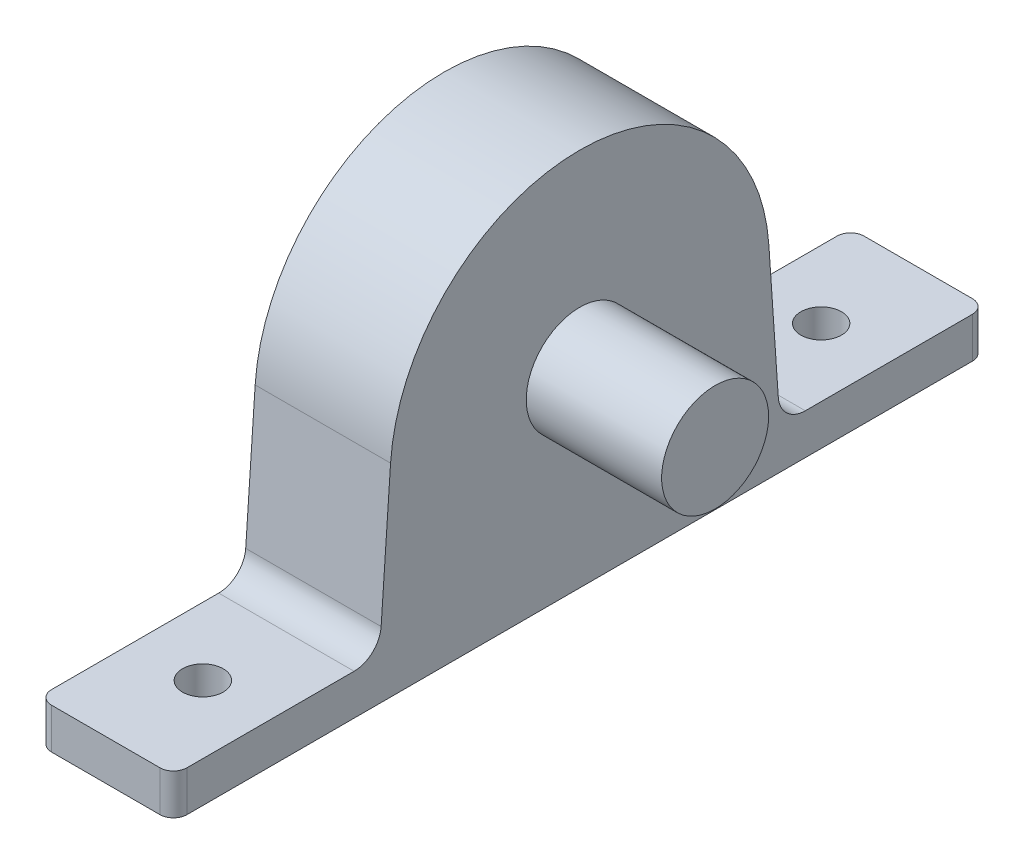
ISO-10303-21;
HEADER;
FILE_DESCRIPTION(('STEP AP214'),'2;1');
FILE_NAME('part.step','',(''),(''),'','','');
FILE_SCHEMA(('AUTOMOTIVE_DESIGN { 1 0 10303 214 1 1 1 1 }'));
ENDSEC;
DATA;
#1=APPLICATION_CONTEXT('core data for automotive mechanical design processes');
#2=APPLICATION_PROTOCOL_DEFINITION('international standard','automotive_design',2000,#1);
#3=PRODUCT_CONTEXT('',#1,'mechanical');
#4=PRODUCT('Part','Part','',(#3));
#5=PRODUCT_RELATED_PRODUCT_CATEGORY('part','',(#4));
#6=PRODUCT_DEFINITION_FORMATION('','',#4);
#7=PRODUCT_DEFINITION_CONTEXT('part definition',#1,'design');
#8=PRODUCT_DEFINITION('design','',#6,#7);
#9=PRODUCT_DEFINITION_SHAPE('','',#8);
#10=(LENGTH_UNIT() NAMED_UNIT(*) SI_UNIT(.MILLI.,.METRE.));
#11=(NAMED_UNIT(*) PLANE_ANGLE_UNIT() SI_UNIT($,.RADIAN.));
#12=(NAMED_UNIT(*) SI_UNIT($,.STERADIAN.) SOLID_ANGLE_UNIT());
#13=UNCERTAINTY_MEASURE_WITH_UNIT(LENGTH_MEASURE(1.E-05),#10,'distance_accuracy_value','');
#14=(GEOMETRIC_REPRESENTATION_CONTEXT(3) GLOBAL_UNCERTAINTY_ASSIGNED_CONTEXT((#13)) GLOBAL_UNIT_ASSIGNED_CONTEXT((#10,
#11,#12)) REPRESENTATION_CONTEXT('',''));
#15=CARTESIAN_POINT('',(0.,0.,0.));
#16=DIRECTION('',(0.,0.,1.));
#17=DIRECTION('',(1.,0.,0.));
#18=AXIS2_PLACEMENT_3D('',#15,#16,#17);
#19=CARTESIAN_POINT('',(-41.0365690573664,1.03079987136159,14.9288257231679));
#20=DIRECTION('',(0.,-0.0688836104513062,-0.997624703087886));
#21=DIRECTION('',(0.,0.997624703087886,-0.0688836104513062));
#22=AXIS2_PLACEMENT_3D('',#19,#20,#21);
#23=PLANE('',#22);
#24=DIRECTION('',(0.,0.997624703087886,-0.0688836104513062));
#25=VECTOR('',#24,1.);
#26=CARTESIAN_POINT('',(0.,1.03079987136159,14.9288257231679));
#27=LINE('',#26,#25);
#28=CARTESIAN_POINT('',(0.,4.86223277909739,14.664274403348));
#29=VERTEX_POINT('',#28);
#30=CARTESIAN_POINT('',(0.,14.9643705463183,13.9667458432304));
#31=VERTEX_POINT('',#30);
#32=EDGE_CURVE('E136',#29,#31,#27,.T.);
#33=ORIENTED_EDGE('',*,*,#32,.F.);
#34=DIRECTION('',(-1.,0.,0.));
#35=VECTOR('',#34,1.);
#36=CARTESIAN_POINT('',(10.,4.86223277909739,14.664274403348));
#37=LINE('',#36,#35);
#38=CARTESIAN_POINT('',(10.,4.86223277909739,14.664274403348));
#39=VERTEX_POINT('',#38);
#40=EDGE_CURVE('E60',#29,#39,#37,.F.);
#41=ORIENTED_EDGE('',*,*,#40,.T.);
#42=DIRECTION('',(0.,0.997624703087886,-0.0688836104513062));
#43=VECTOR('',#42,1.);
#44=CARTESIAN_POINT('',(10.,1.03079987136159,14.9288257231679));
#45=LINE('',#44,#43);
#46=CARTESIAN_POINT('',(10.,14.9643705463183,13.9667458432304));
#47=VERTEX_POINT('',#46);
#48=EDGE_CURVE('E148',#39,#47,#45,.T.);
#49=ORIENTED_EDGE('',*,*,#48,.T.);
#50=DIRECTION('',(1.,0.,0.));
#51=VECTOR('',#50,1.);
#52=CARTESIAN_POINT('',(-41.0365690573664,14.9643705463183,13.9667458432304));
#53=LINE('',#52,#51);
#54=EDGE_CURVE('E147',#31,#47,#53,.T.);
#55=ORIENTED_EDGE('',*,*,#54,.F.);
#56=EDGE_LOOP('',(#33,#41,#49,#55));
#57=FACE_BOUND('',#56,.T.);
#58=ADVANCED_FACE('F39',(#57),#23,.F.);
#59=CARTESIAN_POINT('',(-41.0365690573664,1.03079987136159,-14.9288257231679));
#60=DIRECTION('',(0.,0.068883610451306,-0.997624703087886));
#61=DIRECTION('',(0.,0.997624703087886,0.068883610451306));
#62=AXIS2_PLACEMENT_3D('',#59,#60,#61);
#63=PLANE('',#62);
#64=DIRECTION('',(0.,0.997624703087886,0.068883610451306));
#65=VECTOR('',#64,1.);
#66=CARTESIAN_POINT('',(10.,1.03079987136159,-14.9288257231679));
#67=LINE('',#66,#65);
#68=CARTESIAN_POINT('',(10.,4.86223277909739,-14.664274403348));
#69=VERTEX_POINT('',#68);
#70=CARTESIAN_POINT('',(10.,14.9643705463183,-13.9667458432304));
#71=VERTEX_POINT('',#70);
#72=EDGE_CURVE('E143',#69,#71,#67,.T.);
#73=ORIENTED_EDGE('',*,*,#72,.F.);
#74=DIRECTION('',(-1.,0.,0.));
#75=VECTOR('',#74,1.);
#76=CARTESIAN_POINT('',(-41.0365690573664,4.86223277909739,-14.664274403348));
#77=LINE('',#76,#75);
#78=CARTESIAN_POINT('',(0.,4.86223277909739,-14.664274403348));
#79=VERTEX_POINT('',#78);
#80=EDGE_CURVE('E214',#69,#79,#77,.T.);
#81=ORIENTED_EDGE('',*,*,#80,.T.);
#82=DIRECTION('',(0.,0.997624703087886,0.068883610451306));
#83=VECTOR('',#82,1.);
#84=CARTESIAN_POINT('',(0.,1.03079987136159,-14.9288257231679));
#85=LINE('',#84,#83);
#86=CARTESIAN_POINT('',(0.,14.9643705463183,-13.9667458432304));
#87=VERTEX_POINT('',#86);
#88=EDGE_CURVE('E161',#79,#87,#85,.T.);
#89=ORIENTED_EDGE('',*,*,#88,.T.);
#90=DIRECTION('',(1.,0.,0.));
#91=VECTOR('',#90,1.);
#92=CARTESIAN_POINT('',(-41.0365690573664,14.9643705463183,-13.9667458432304));
#93=LINE('',#92,#91);
#94=EDGE_CURVE('E155',#87,#71,#93,.T.);
#95=ORIENTED_EDGE('',*,*,#94,.T.);
#96=EDGE_LOOP('',(#73,#81,#89,#95));
#97=FACE_BOUND('',#96,.T.);
#98=ADVANCED_FACE('F238',(#97),#63,.T.);
#99=CARTESIAN_POINT('',(10.,0.,15.));
#100=DIRECTION('',(0.,1.,0.));
#101=DIRECTION('',(0.,0.,1.));
#102=AXIS2_PLACEMENT_3D('',#99,#100,#101);
#103=PLANE('',#102);
#104=CARTESIAN_POINT('',(5.,0.,-22.8297619047619));
#105=DIRECTION('',(0.,1.,0.));
#106=DIRECTION('',(0.,0.,1.));
#107=AXIS2_PLACEMENT_3D('',#104,#105,#106);
#108=CIRCLE('',#107,1.5);
#109=CARTESIAN_POINT('',(5.,0.,-21.3297619047619));
#110=VERTEX_POINT('',#109);
#111=EDGE_CURVE('E265',#110,#110,#108,.T.);
#112=ORIENTED_EDGE('',*,*,#111,.T.);
#113=EDGE_LOOP('',(#112));
#114=FACE_BOUND('',#113,.T.);
#115=CARTESIAN_POINT('',(5.,0.,22.8297619047619));
#116=DIRECTION('',(0.,1.,0.));
#117=DIRECTION('',(0.,0.,1.));
#118=AXIS2_PLACEMENT_3D('',#115,#116,#117);
#119=CIRCLE('',#118,1.5);
#120=CARTESIAN_POINT('',(5.,0.,24.3297619047619));
#121=VERTEX_POINT('',#120);
#122=EDGE_CURVE('E275',#121,#121,#119,.T.);
#123=ORIENTED_EDGE('',*,*,#122,.T.);
#124=EDGE_LOOP('',(#123));
#125=FACE_BOUND('',#124,.T.);
#126=DIRECTION('',(0.,0.,-1.));
#127=VECTOR('',#126,1.);
#128=CARTESIAN_POINT('',(0.,0.,15.));
#129=LINE('',#128,#127);
#130=CARTESIAN_POINT('',(0.,0.,29.));
#131=VERTEX_POINT('',#130);
#132=CARTESIAN_POINT('',(0.,0.,-29.));
#133=VERTEX_POINT('',#132);
#134=EDGE_CURVE('E167',#131,#133,#129,.T.);
#135=ORIENTED_EDGE('',*,*,#134,.T.);
#136=CARTESIAN_POINT('',(1.,0.,-29.));
#137=DIRECTION('',(0.,1.,0.));
#138=DIRECTION('',(0.,0.,1.));
#139=AXIS2_PLACEMENT_3D('',#136,#137,#138);
#140=CIRCLE('',#139,1.);
#141=CARTESIAN_POINT('',(1.,0.,-30.));
#142=VERTEX_POINT('',#141);
#143=EDGE_CURVE('E187',#133,#142,#140,.F.);
#144=ORIENTED_EDGE('',*,*,#143,.T.);
#145=DIRECTION('',(1.,0.,0.));
#146=VECTOR('',#145,1.);
#147=CARTESIAN_POINT('',(0.,0.,-30.));
#148=LINE('',#147,#146);
#149=CARTESIAN_POINT('',(9.,0.,-30.));
#150=VERTEX_POINT('',#149);
#151=EDGE_CURVE('E252',#142,#150,#148,.T.);
#152=ORIENTED_EDGE('',*,*,#151,.T.);
#153=CARTESIAN_POINT('',(9.,0.,-29.));
#154=DIRECTION('',(0.,1.,0.));
#155=DIRECTION('',(0.,0.,1.));
#156=AXIS2_PLACEMENT_3D('',#153,#154,#155);
#157=CIRCLE('',#156,1.);
#158=CARTESIAN_POINT('',(10.,0.,-29.));
#159=VERTEX_POINT('',#158);
#160=EDGE_CURVE('E181',#150,#159,#157,.F.);
#161=ORIENTED_EDGE('',*,*,#160,.T.);
#162=DIRECTION('',(0.,0.,-1.));
#163=VECTOR('',#162,1.);
#164=CARTESIAN_POINT('',(10.,0.,15.));
#165=LINE('',#164,#163);
#166=CARTESIAN_POINT('',(10.,0.,29.));
#167=VERTEX_POINT('',#166);
#168=EDGE_CURVE('E172',#167,#159,#165,.T.);
#169=ORIENTED_EDGE('',*,*,#168,.F.);
#170=CARTESIAN_POINT('',(9.,0.,29.));
#171=DIRECTION('',(0.,1.,0.));
#172=DIRECTION('',(0.,0.,1.));
#173=AXIS2_PLACEMENT_3D('',#170,#171,#172);
#174=CIRCLE('',#173,1.);
#175=CARTESIAN_POINT('',(9.,0.,30.));
#176=VERTEX_POINT('',#175);
#177=EDGE_CURVE('E183',#167,#176,#174,.F.);
#178=ORIENTED_EDGE('',*,*,#177,.T.);
#179=DIRECTION('',(-1.,0.,0.));
#180=VECTOR('',#179,1.);
#181=CARTESIAN_POINT('',(0.,0.,30.));
#182=LINE('',#181,#180);
#183=CARTESIAN_POINT('',(1.,0.,30.));
#184=VERTEX_POINT('',#183);
#185=EDGE_CURVE('E248',#176,#184,#182,.T.);
#186=ORIENTED_EDGE('',*,*,#185,.T.);
#187=CARTESIAN_POINT('',(1.,0.,29.));
#188=DIRECTION('',(0.,1.,0.));
#189=DIRECTION('',(0.,0.,1.));
#190=AXIS2_PLACEMENT_3D('',#187,#188,#189);
#191=CIRCLE('',#190,1.);
#192=EDGE_CURVE('E185',#184,#131,#191,.F.);
#193=ORIENTED_EDGE('',*,*,#192,.T.);
#194=EDGE_LOOP('',(#135,#144,#152,#161,#169,#178,#186,#193));
#195=FACE_BOUND('',#194,.T.);
#196=ADVANCED_FACE('F314',(#114,#125,#195),#103,.F.);
#197=CARTESIAN_POINT('',(10.,14.,0.));
#198=DIRECTION('',(-1.,0.,0.));
#199=DIRECTION('',(0.,0.,1.));
#200=AXIS2_PLACEMENT_3D('',#197,#198,#199);
#201=PLANE('',#200);
#202=ORIENTED_EDGE('',*,*,#48,.F.);
#203=CARTESIAN_POINT('',(10.,5.,16.6595238095238));
#204=DIRECTION('',(-1.,0.,0.));
#205=DIRECTION('',(0.,0.,1.));
#206=AXIS2_PLACEMENT_3D('',#203,#204,#205);
#207=CIRCLE('',#206,2.);
#208=CARTESIAN_POINT('',(10.,3.,16.6595238095238));
#209=VERTEX_POINT('',#208);
#210=EDGE_CURVE('E11',#39,#209,#207,.T.);
#211=ORIENTED_EDGE('',*,*,#210,.T.);
#212=DIRECTION('',(0.,0.,1.));
#213=VECTOR('',#212,1.);
#214=CARTESIAN_POINT('',(10.,3.,30.));
#215=LINE('',#214,#213);
#216=CARTESIAN_POINT('',(10.,3.,29.));
#217=VERTEX_POINT('',#216);
#218=EDGE_CURVE('E260',#209,#217,#215,.T.);
#219=ORIENTED_EDGE('',*,*,#218,.T.);
#220=DIRECTION('',(0.,-1.,0.));
#221=VECTOR('',#220,1.);
#222=CARTESIAN_POINT('',(10.,0.,29.));
#223=LINE('',#222,#221);
#224=EDGE_CURVE('E211',#217,#167,#223,.T.);
#225=ORIENTED_EDGE('',*,*,#224,.T.);
#226=ORIENTED_EDGE('',*,*,#168,.T.);
#227=DIRECTION('',(0.,-1.,0.));
#228=VECTOR('',#227,1.);
#229=CARTESIAN_POINT('',(10.,3.,-29.));
#230=LINE('',#229,#228);
#231=CARTESIAN_POINT('',(10.,3.,-29.));
#232=VERTEX_POINT('',#231);
#233=EDGE_CURVE('E209',#159,#232,#230,.F.);
#234=ORIENTED_EDGE('',*,*,#233,.T.);
#235=CARTESIAN_POINT('',(10.,3.,-16.6595238095238));
#236=VERTEX_POINT('',#235);
#237=EDGE_CURVE('E233',#232,#236,#215,.T.);
#238=ORIENTED_EDGE('',*,*,#237,.T.);
#239=CARTESIAN_POINT('',(10.,5.,-16.6595238095238));
#240=DIRECTION('',(-1.,0.,0.));
#241=DIRECTION('',(0.,0.,1.));
#242=AXIS2_PLACEMENT_3D('',#239,#240,#241);
#243=CIRCLE('',#242,2.);
#244=EDGE_CURVE('E225',#236,#69,#243,.T.);
#245=ORIENTED_EDGE('',*,*,#244,.T.);
#246=ORIENTED_EDGE('',*,*,#72,.T.);
#247=CARTESIAN_POINT('',(10.,14.,0.));
#248=DIRECTION('',(1.,0.,0.));
#249=DIRECTION('',(0.,0.,-1.));
#250=AXIS2_PLACEMENT_3D('',#247,#248,#249);
#251=CIRCLE('',#250,14.);
#252=EDGE_CURVE('E156',#71,#47,#251,.T.);
#253=ORIENTED_EDGE('',*,*,#252,.T.);
#254=EDGE_LOOP('',(#202,#211,#219,#225,#226,#234,#238,#245,#246,#253));
#255=FACE_BOUND('',#254,.T.);
#256=CARTESIAN_POINT('',(10.,14.,0.));
#257=DIRECTION('',(1.,0.,0.));
#258=DIRECTION('',(0.,0.,-1.));
#259=AXIS2_PLACEMENT_3D('',#256,#257,#258);
#260=CIRCLE('',#259,3.95);
#261=CARTESIAN_POINT('',(10.,14.,-3.95));
#262=VERTEX_POINT('',#261);
#263=EDGE_CURVE('E168',#262,#262,#260,.T.);
#264=ORIENTED_EDGE('',*,*,#263,.F.);
#265=EDGE_LOOP('',(#264));
#266=FACE_BOUND('',#265,.T.);
#267=ADVANCED_FACE('F230',(#255,#266),#201,.F.);
#268=CARTESIAN_POINT('',(0.,14.,0.));
#269=DIRECTION('',(-1.,0.,0.));
#270=DIRECTION('',(0.,0.,1.));
#271=AXIS2_PLACEMENT_3D('',#268,#269,#270);
#272=PLANE('',#271);
#273=ORIENTED_EDGE('',*,*,#88,.F.);
#274=CARTESIAN_POINT('',(0.,5.,-16.6595238095238));
#275=DIRECTION('',(-1.,0.,0.));
#276=DIRECTION('',(0.,0.,1.));
#277=AXIS2_PLACEMENT_3D('',#274,#275,#276);
#278=CIRCLE('',#277,2.);
#279=CARTESIAN_POINT('',(0.,3.,-16.6595238095238));
#280=VERTEX_POINT('',#279);
#281=EDGE_CURVE('E223',#79,#280,#278,.F.);
#282=ORIENTED_EDGE('',*,*,#281,.T.);
#283=DIRECTION('',(0.,0.,-1.));
#284=VECTOR('',#283,1.);
#285=CARTESIAN_POINT('',(0.,3.,30.));
#286=LINE('',#285,#284);
#287=CARTESIAN_POINT('',(0.,3.,-29.));
#288=VERTEX_POINT('',#287);
#289=EDGE_CURVE('E241',#280,#288,#286,.T.);
#290=ORIENTED_EDGE('',*,*,#289,.T.);
#291=DIRECTION('',(0.,-1.,0.));
#292=VECTOR('',#291,1.);
#293=CARTESIAN_POINT('',(0.,14.,-29.));
#294=LINE('',#293,#292);
#295=EDGE_CURVE('E178',#288,#133,#294,.T.);
#296=ORIENTED_EDGE('',*,*,#295,.T.);
#297=ORIENTED_EDGE('',*,*,#134,.F.);
#298=DIRECTION('',(0.,-1.,0.));
#299=VECTOR('',#298,1.);
#300=CARTESIAN_POINT('',(0.,14.,29.));
#301=LINE('',#300,#299);
#302=CARTESIAN_POINT('',(0.,3.,29.));
#303=VERTEX_POINT('',#302);
#304=EDGE_CURVE('E171',#131,#303,#301,.F.);
#305=ORIENTED_EDGE('',*,*,#304,.T.);
#306=CARTESIAN_POINT('',(0.,3.,16.6595238095238));
#307=VERTEX_POINT('',#306);
#308=EDGE_CURVE('E247',#303,#307,#286,.T.);
#309=ORIENTED_EDGE('',*,*,#308,.T.);
#310=CARTESIAN_POINT('',(0.,5.,16.6595238095238));
#311=DIRECTION('',(-1.,0.,0.));
#312=DIRECTION('',(0.,0.,1.));
#313=AXIS2_PLACEMENT_3D('',#310,#311,#312);
#314=CIRCLE('',#313,2.);
#315=EDGE_CURVE('E47',#307,#29,#314,.F.);
#316=ORIENTED_EDGE('',*,*,#315,.T.);
#317=ORIENTED_EDGE('',*,*,#32,.T.);
#318=CARTESIAN_POINT('',(0.,14.,0.));
#319=DIRECTION('',(-1.,0.,0.));
#320=DIRECTION('',(0.,0.,1.));
#321=AXIS2_PLACEMENT_3D('',#318,#319,#320);
#322=CIRCLE('',#321,14.);
#323=EDGE_CURVE('E141',#87,#31,#322,.F.);
#324=ORIENTED_EDGE('',*,*,#323,.F.);
#325=EDGE_LOOP('',(#273,#282,#290,#296,#297,#305,#309,#316,#317,#324));
#326=FACE_BOUND('',#325,.T.);
#327=ADVANCED_FACE('F139',(#326),#272,.T.);
#328=CARTESIAN_POINT('',(20.,14.,0.));
#329=DIRECTION('',(-1.,0.,0.));
#330=DIRECTION('',(0.,0.,1.));
#331=AXIS2_PLACEMENT_3D('',#328,#329,#330);
#332=CYLINDRICAL_SURFACE('',#331,3.95);
#333=CARTESIAN_POINT('',(20.,14.,0.));
#334=DIRECTION('',(1.,0.,0.));
#335=DIRECTION('',(0.,0.,-1.));
#336=AXIS2_PLACEMENT_3D('',#333,#334,#335);
#337=CIRCLE('',#336,3.95);
#338=CARTESIAN_POINT('',(20.,14.,-3.95));
#339=VERTEX_POINT('',#338);
#340=EDGE_CURVE('E164',#339,#339,#337,.T.);
#341=ORIENTED_EDGE('',*,*,#340,.F.);
#342=EDGE_LOOP('',(#341));
#343=FACE_BOUND('',#342,.T.);
#344=ORIENTED_EDGE('',*,*,#263,.T.);
#345=EDGE_LOOP('',(#344));
#346=FACE_BOUND('',#345,.T.);
#347=ADVANCED_FACE('F324',(#343,#346),#332,.T.);
#348=CARTESIAN_POINT('',(20.,14.,0.));
#349=DIRECTION('',(1.,0.,0.));
#350=DIRECTION('',(0.,0.,-1.));
#351=AXIS2_PLACEMENT_3D('',#348,#349,#350);
#352=PLANE('',#351);
#353=ORIENTED_EDGE('',*,*,#340,.T.);
#354=EDGE_LOOP('',(#353));
#355=FACE_BOUND('',#354,.T.);
#356=ADVANCED_FACE('F321',(#355),#352,.T.);
#357=CARTESIAN_POINT('',(-41.0365690573664,14.,0.));
#358=DIRECTION('',(1.,0.,0.));
#359=DIRECTION('',(0.,0.,-1.));
#360=AXIS2_PLACEMENT_3D('',#357,#358,#359);
#361=CYLINDRICAL_SURFACE('',#360,14.);
#362=ORIENTED_EDGE('',*,*,#94,.F.);
#363=ORIENTED_EDGE('',*,*,#323,.T.);
#364=ORIENTED_EDGE('',*,*,#54,.T.);
#365=ORIENTED_EDGE('',*,*,#252,.F.);
#366=EDGE_LOOP('',(#362,#363,#364,#365));
#367=FACE_BOUND('',#366,.T.);
#368=ADVANCED_FACE('F153',(#367),#361,.T.);
#369=CARTESIAN_POINT('',(0.,3.,-30.));
#370=DIRECTION('',(0.,0.,-1.));
#371=DIRECTION('',(-1.,0.,0.));
#372=AXIS2_PLACEMENT_3D('',#369,#370,#371);
#373=PLANE('',#372);
#374=ORIENTED_EDGE('',*,*,#151,.F.);
#375=DIRECTION('',(0.,-1.,0.));
#376=VECTOR('',#375,1.);
#377=CARTESIAN_POINT('',(1.,3.,-30.));
#378=LINE('',#377,#376);
#379=CARTESIAN_POINT('',(1.,3.,-30.));
#380=VERTEX_POINT('',#379);
#381=EDGE_CURVE('E192',#142,#380,#378,.F.);
#382=ORIENTED_EDGE('',*,*,#381,.T.);
#383=DIRECTION('',(1.,0.,0.));
#384=VECTOR('',#383,1.);
#385=CARTESIAN_POINT('',(0.,3.,-30.));
#386=LINE('',#385,#384);
#387=CARTESIAN_POINT('',(9.,3.,-30.));
#388=VERTEX_POINT('',#387);
#389=EDGE_CURVE('E250',#380,#388,#386,.T.);
#390=ORIENTED_EDGE('',*,*,#389,.T.);
#391=DIRECTION('',(0.,-1.,0.));
#392=VECTOR('',#391,1.);
#393=CARTESIAN_POINT('',(9.,0.,-30.));
#394=LINE('',#393,#392);
#395=EDGE_CURVE('E189',#388,#150,#394,.T.);
#396=ORIENTED_EDGE('',*,*,#395,.T.);
#397=EDGE_LOOP('',(#374,#382,#390,#396));
#398=FACE_BOUND('',#397,.T.);
#399=ADVANCED_FACE('F320',(#398),#373,.T.);
#400=CARTESIAN_POINT('',(0.,3.,0.));
#401=DIRECTION('',(0.,-1.,0.));
#402=DIRECTION('',(0.,0.,-1.));
#403=AXIS2_PLACEMENT_3D('',#400,#401,#402);
#404=PLANE('',#403);
#405=CARTESIAN_POINT('',(5.,3.,-22.8297619047619));
#406=DIRECTION('',(0.,1.,0.));
#407=DIRECTION('',(0.,0.,1.));
#408=AXIS2_PLACEMENT_3D('',#405,#406,#407);
#409=CIRCLE('',#408,1.5);
#410=CARTESIAN_POINT('',(5.,3.,-21.3297619047619));
#411=VERTEX_POINT('',#410);
#412=EDGE_CURVE('E270',#411,#411,#409,.T.);
#413=ORIENTED_EDGE('',*,*,#412,.F.);
#414=EDGE_LOOP('',(#413));
#415=FACE_BOUND('',#414,.T.);
#416=ORIENTED_EDGE('',*,*,#289,.F.);
#417=DIRECTION('',(-1.,0.,0.));
#418=VECTOR('',#417,1.);
#419=CARTESIAN_POINT('',(0.,3.,-16.6595238095238));
#420=LINE('',#419,#418);
#421=EDGE_CURVE('E217',#280,#236,#420,.F.);
#422=ORIENTED_EDGE('',*,*,#421,.T.);
#423=ORIENTED_EDGE('',*,*,#237,.F.);
#424=CARTESIAN_POINT('',(9.,3.,-29.));
#425=DIRECTION('',(0.,-1.,0.));
#426=DIRECTION('',(0.,0.,-1.));
#427=AXIS2_PLACEMENT_3D('',#424,#425,#426);
#428=CIRCLE('',#427,1.);
#429=EDGE_CURVE('E194',#232,#388,#428,.F.);
#430=ORIENTED_EDGE('',*,*,#429,.T.);
#431=ORIENTED_EDGE('',*,*,#389,.F.);
#432=CARTESIAN_POINT('',(1.,3.,-29.));
#433=DIRECTION('',(0.,-1.,0.));
#434=DIRECTION('',(0.,0.,-1.));
#435=AXIS2_PLACEMENT_3D('',#432,#433,#434);
#436=CIRCLE('',#435,1.);
#437=EDGE_CURVE('E196',#380,#288,#436,.F.);
#438=ORIENTED_EDGE('',*,*,#437,.T.);
#439=EDGE_LOOP('',(#416,#422,#423,#430,#431,#438));
#440=FACE_BOUND('',#439,.T.);
#441=ADVANCED_FACE('F243',(#415,#440),#404,.F.);
#442=CARTESIAN_POINT('',(5.,3.,22.8297619047619));
#443=DIRECTION('',(0.,1.,0.));
#444=DIRECTION('',(0.,0.,1.));
#445=AXIS2_PLACEMENT_3D('',#442,#443,#444);
#446=CIRCLE('',#445,1.5);
#447=CARTESIAN_POINT('',(5.,3.,24.3297619047619));
#448=VERTEX_POINT('',#447);
#449=EDGE_CURVE('E256',#448,#448,#446,.T.);
#450=ORIENTED_EDGE('',*,*,#449,.F.);
#451=EDGE_LOOP('',(#450));
#452=FACE_BOUND('',#451,.T.);
#453=ORIENTED_EDGE('',*,*,#218,.F.);
#454=DIRECTION('',(-1.,0.,0.));
#455=VECTOR('',#454,1.);
#456=CARTESIAN_POINT('',(0.,3.,16.6595238095238));
#457=LINE('',#456,#455);
#458=EDGE_CURVE('E219',#209,#307,#457,.T.);
#459=ORIENTED_EDGE('',*,*,#458,.T.);
#460=ORIENTED_EDGE('',*,*,#308,.F.);
#461=CARTESIAN_POINT('',(1.,3.,29.));
#462=DIRECTION('',(0.,-1.,0.));
#463=DIRECTION('',(0.,0.,-1.));
#464=AXIS2_PLACEMENT_3D('',#461,#462,#463);
#465=CIRCLE('',#464,1.);
#466=CARTESIAN_POINT('',(1.,3.,30.));
#467=VERTEX_POINT('',#466);
#468=EDGE_CURVE('E207',#303,#467,#465,.F.);
#469=ORIENTED_EDGE('',*,*,#468,.T.);
#470=DIRECTION('',(-1.,0.,0.));
#471=VECTOR('',#470,1.);
#472=CARTESIAN_POINT('',(0.,3.,30.));
#473=LINE('',#472,#471);
#474=CARTESIAN_POINT('',(9.,3.,30.));
#475=VERTEX_POINT('',#474);
#476=EDGE_CURVE('E144',#475,#467,#473,.T.);
#477=ORIENTED_EDGE('',*,*,#476,.F.);
#478=CARTESIAN_POINT('',(9.,3.,29.));
#479=DIRECTION('',(0.,-1.,0.));
#480=DIRECTION('',(0.,0.,-1.));
#481=AXIS2_PLACEMENT_3D('',#478,#479,#480);
#482=CIRCLE('',#481,1.);
#483=EDGE_CURVE('E204',#475,#217,#482,.F.);
#484=ORIENTED_EDGE('',*,*,#483,.T.);
#485=EDGE_LOOP('',(#453,#459,#460,#469,#477,#484));
#486=FACE_BOUND('',#485,.T.);
#487=ADVANCED_FACE('F285',(#452,#486),#404,.F.);
#488=CARTESIAN_POINT('',(0.,3.,30.));
#489=DIRECTION('',(0.,0.,1.));
#490=DIRECTION('',(1.,0.,0.));
#491=AXIS2_PLACEMENT_3D('',#488,#489,#490);
#492=PLANE('',#491);
#493=ORIENTED_EDGE('',*,*,#476,.T.);
#494=DIRECTION('',(0.,-1.,0.));
#495=VECTOR('',#494,1.);
#496=CARTESIAN_POINT('',(1.,3.,30.));
#497=LINE('',#496,#495);
#498=EDGE_CURVE('E201',#467,#184,#497,.T.);
#499=ORIENTED_EDGE('',*,*,#498,.T.);
#500=ORIENTED_EDGE('',*,*,#185,.F.);
#501=DIRECTION('',(0.,-1.,0.));
#502=VECTOR('',#501,1.);
#503=CARTESIAN_POINT('',(9.,3.,30.));
#504=LINE('',#503,#502);
#505=EDGE_CURVE('E199',#176,#475,#504,.F.);
#506=ORIENTED_EDGE('',*,*,#505,.T.);
#507=EDGE_LOOP('',(#493,#499,#500,#506));
#508=FACE_BOUND('',#507,.T.);
#509=ADVANCED_FACE('F288',(#508),#492,.T.);
#510=CARTESIAN_POINT('',(1.,14.,-29.));
#511=DIRECTION('',(0.,-1.,0.));
#512=DIRECTION('',(0.,0.,-1.));
#513=AXIS2_PLACEMENT_3D('',#510,#511,#512);
#514=CYLINDRICAL_SURFACE('',#513,1.);
#515=ORIENTED_EDGE('',*,*,#437,.F.);
#516=ORIENTED_EDGE('',*,*,#381,.F.);
#517=ORIENTED_EDGE('',*,*,#143,.F.);
#518=ORIENTED_EDGE('',*,*,#295,.F.);
#519=EDGE_LOOP('',(#515,#516,#517,#518));
#520=FACE_BOUND('',#519,.T.);
#521=ADVANCED_FACE('F334',(#520),#514,.T.);
#522=CARTESIAN_POINT('',(1.,3.,29.));
#523=DIRECTION('',(0.,-1.,0.));
#524=DIRECTION('',(0.,0.,-1.));
#525=AXIS2_PLACEMENT_3D('',#522,#523,#524);
#526=CYLINDRICAL_SURFACE('',#525,1.);
#527=ORIENTED_EDGE('',*,*,#468,.F.);
#528=ORIENTED_EDGE('',*,*,#304,.F.);
#529=ORIENTED_EDGE('',*,*,#192,.F.);
#530=ORIENTED_EDGE('',*,*,#498,.F.);
#531=EDGE_LOOP('',(#527,#528,#529,#530));
#532=FACE_BOUND('',#531,.T.);
#533=ADVANCED_FACE('F337',(#532),#526,.T.);
#534=CARTESIAN_POINT('',(9.,14.,29.));
#535=DIRECTION('',(0.,1.,0.));
#536=DIRECTION('',(0.,0.,1.));
#537=AXIS2_PLACEMENT_3D('',#534,#535,#536);
#538=CYLINDRICAL_SURFACE('',#537,1.);
#539=ORIENTED_EDGE('',*,*,#483,.F.);
#540=ORIENTED_EDGE('',*,*,#505,.F.);
#541=ORIENTED_EDGE('',*,*,#177,.F.);
#542=ORIENTED_EDGE('',*,*,#224,.F.);
#543=EDGE_LOOP('',(#539,#540,#541,#542));
#544=FACE_BOUND('',#543,.T.);
#545=ADVANCED_FACE('F341',(#544),#538,.T.);
#546=CARTESIAN_POINT('',(9.,3.,-29.));
#547=DIRECTION('',(0.,1.,0.));
#548=DIRECTION('',(0.,0.,1.));
#549=AXIS2_PLACEMENT_3D('',#546,#547,#548);
#550=CYLINDRICAL_SURFACE('',#549,1.);
#551=ORIENTED_EDGE('',*,*,#429,.F.);
#552=ORIENTED_EDGE('',*,*,#233,.F.);
#553=ORIENTED_EDGE('',*,*,#160,.F.);
#554=ORIENTED_EDGE('',*,*,#395,.F.);
#555=EDGE_LOOP('',(#551,#552,#553,#554));
#556=FACE_BOUND('',#555,.T.);
#557=ADVANCED_FACE('F307',(#556),#550,.T.);
#558=CARTESIAN_POINT('',(-41.0365690573664,5.,-16.6595238095238));
#559=DIRECTION('',(-1.,0.,0.));
#560=DIRECTION('',(0.,0.,1.));
#561=AXIS2_PLACEMENT_3D('',#558,#559,#560);
#562=CYLINDRICAL_SURFACE('',#561,2.);
#563=ORIENTED_EDGE('',*,*,#244,.F.);
#564=ORIENTED_EDGE('',*,*,#421,.F.);
#565=ORIENTED_EDGE('',*,*,#281,.F.);
#566=ORIENTED_EDGE('',*,*,#80,.F.);
#567=EDGE_LOOP('',(#563,#564,#565,#566));
#568=FACE_BOUND('',#567,.T.);
#569=ADVANCED_FACE('F239',(#568),#562,.F.);
#570=CARTESIAN_POINT('',(0.,5.,16.6595238095238));
#571=DIRECTION('',(1.,0.,0.));
#572=DIRECTION('',(0.,0.,-1.));
#573=AXIS2_PLACEMENT_3D('',#570,#571,#572);
#574=CYLINDRICAL_SURFACE('',#573,2.);
#575=ORIENTED_EDGE('',*,*,#210,.F.);
#576=ORIENTED_EDGE('',*,*,#40,.F.);
#577=ORIENTED_EDGE('',*,*,#315,.F.);
#578=ORIENTED_EDGE('',*,*,#458,.F.);
#579=EDGE_LOOP('',(#575,#576,#577,#578));
#580=FACE_BOUND('',#579,.T.);
#581=ADVANCED_FACE('F41',(#580),#574,.F.);
#582=CARTESIAN_POINT('',(5.,0.,22.8297619047619));
#583=DIRECTION('',(0.,1.,0.));
#584=DIRECTION('',(0.,0.,1.));
#585=AXIS2_PLACEMENT_3D('',#582,#583,#584);
#586=CYLINDRICAL_SURFACE('',#585,1.5);
#587=ORIENTED_EDGE('',*,*,#122,.F.);
#588=EDGE_LOOP('',(#587));
#589=FACE_BOUND('',#588,.T.);
#590=ORIENTED_EDGE('',*,*,#449,.T.);
#591=EDGE_LOOP('',(#590));
#592=FACE_BOUND('',#591,.T.);
#593=ADVANCED_FACE('F283',(#589,#592),#586,.F.);
#594=CARTESIAN_POINT('',(5.,0.,-22.8297619047619));
#595=DIRECTION('',(0.,1.,0.));
#596=DIRECTION('',(0.,0.,1.));
#597=AXIS2_PLACEMENT_3D('',#594,#595,#596);
#598=CYLINDRICAL_SURFACE('',#597,1.5);
#599=ORIENTED_EDGE('',*,*,#111,.F.);
#600=EDGE_LOOP('',(#599));
#601=FACE_BOUND('',#600,.T.);
#602=ORIENTED_EDGE('',*,*,#412,.T.);
#603=EDGE_LOOP('',(#602));
#604=FACE_BOUND('',#603,.T.);
#605=ADVANCED_FACE('F304',(#601,#604),#598,.F.);
#606=CLOSED_SHELL('',(#58,#98,#196,#267,#327,#347,#356,#368,#399,#441,#487,#509,#521,#533,#545,
#557,#569,#581,#593,#605));
#607=MANIFOLD_SOLID_BREP('B2',#606);
#608=ADVANCED_BREP_SHAPE_REPRESENTATION('',(#18,#607),#14);
#609=SHAPE_DEFINITION_REPRESENTATION(#9,#608);
ENDSEC;
END-ISO-10303-21;
